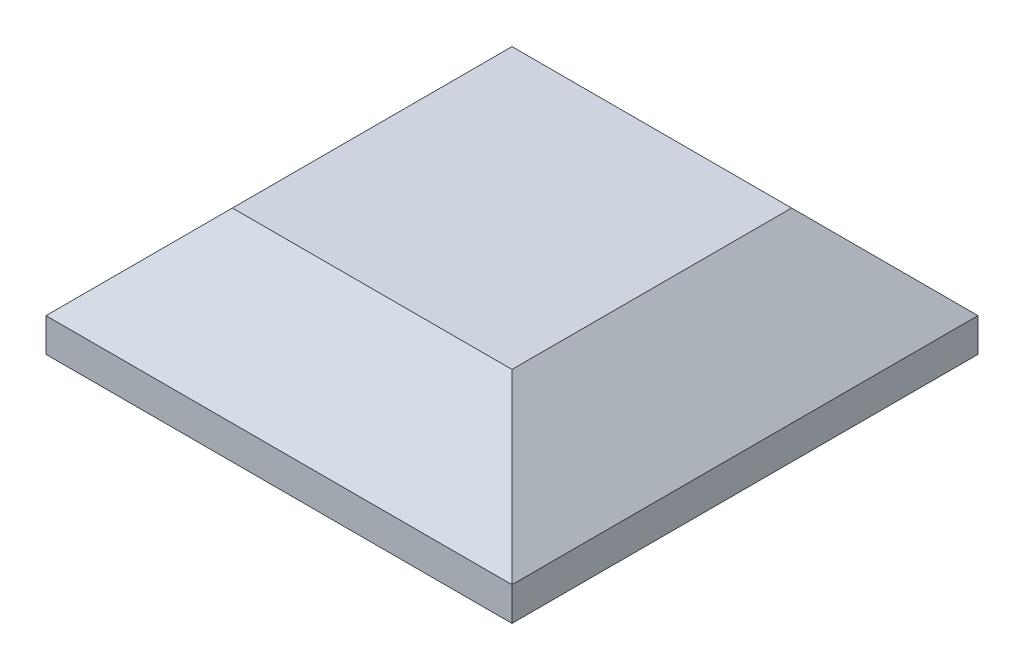
ISO-10303-21;
HEADER;
FILE_DESCRIPTION(('STEP AP214'),'2;1');
FILE_NAME('part.step','',(''),(''),'','','');
FILE_SCHEMA(('AUTOMOTIVE_DESIGN { 1 0 10303 214 1 1 1 1 }'));
ENDSEC;
DATA;
#1=APPLICATION_CONTEXT('core data for automotive mechanical design processes');
#2=APPLICATION_PROTOCOL_DEFINITION('international standard','automotive_design',2000,#1);
#3=PRODUCT_CONTEXT('',#1,'mechanical');
#4=PRODUCT('Part','Part','',(#3));
#5=PRODUCT_RELATED_PRODUCT_CATEGORY('part','',(#4));
#6=PRODUCT_DEFINITION_FORMATION('','',#4);
#7=PRODUCT_DEFINITION_CONTEXT('part definition',#1,'design');
#8=PRODUCT_DEFINITION('design','',#6,#7);
#9=PRODUCT_DEFINITION_SHAPE('','',#8);
#10=(LENGTH_UNIT() NAMED_UNIT(*) SI_UNIT(.MILLI.,.METRE.));
#11=(NAMED_UNIT(*) PLANE_ANGLE_UNIT() SI_UNIT($,.RADIAN.));
#12=(NAMED_UNIT(*) SI_UNIT($,.STERADIAN.) SOLID_ANGLE_UNIT());
#13=UNCERTAINTY_MEASURE_WITH_UNIT(LENGTH_MEASURE(1.E-05),#10,'distance_accuracy_value','');
#14=(GEOMETRIC_REPRESENTATION_CONTEXT(3) GLOBAL_UNCERTAINTY_ASSIGNED_CONTEXT((#13)) GLOBAL_UNIT_ASSIGNED_CONTEXT((#10,
#11,#12)) REPRESENTATION_CONTEXT('',''));
#15=CARTESIAN_POINT('',(0.,0.,0.));
#16=DIRECTION('',(0.,0.,1.));
#17=DIRECTION('',(1.,0.,0.));
#18=AXIS2_PLACEMENT_3D('',#15,#16,#17);
#19=CARTESIAN_POINT('',(0.715042372881359,3.4,5.03177966101695));
#20=DIRECTION('',(-1.,0.,0.));
#21=DIRECTION('',(0.,0.,1.));
#22=AXIS2_PLACEMENT_3D('',#19,#20,#21);
#23=PLANE('',#22);
#24=DIRECTION('',(0.,-1.,0.));
#25=VECTOR('',#24,1.);
#26=CARTESIAN_POINT('',(0.715042372881359,3.4,-7.46822033898305));
#27=LINE('',#26,#25);
#28=CARTESIAN_POINT('',(0.715042372881359,0.899999999999991,-7.46822033898305));
#29=VERTEX_POINT('',#28);
#30=CARTESIAN_POINT('',(0.715042372881359,0.,-7.46822033898305));
#31=VERTEX_POINT('',#30);
#32=EDGE_CURVE('E89',#29,#31,#27,.T.);
#33=ORIENTED_EDGE('',*,*,#32,.F.);
#34=DIRECTION('',(0.,0.,1.));
#35=VECTOR('',#34,1.);
#36=CARTESIAN_POINT('',(0.715042372881359,0.899999999999991,5.03177966101695));
#37=LINE('',#36,#35);
#38=CARTESIAN_POINT('',(0.715042372881359,0.899999999999991,5.03177966101695));
#39=VERTEX_POINT('',#38);
#40=EDGE_CURVE('E11',#29,#39,#37,.T.);
#41=ORIENTED_EDGE('',*,*,#40,.T.);
#42=DIRECTION('',(0.,-1.,0.));
#43=VECTOR('',#42,1.);
#44=CARTESIAN_POINT('',(0.715042372881359,3.4,5.03177966101695));
#45=LINE('',#44,#43);
#46=CARTESIAN_POINT('',(0.715042372881359,0.,5.03177966101695));
#47=VERTEX_POINT('',#46);
#48=EDGE_CURVE('E109',#39,#47,#45,.T.);
#49=ORIENTED_EDGE('',*,*,#48,.T.);
#50=DIRECTION('',(0.,0.,-1.));
#51=VECTOR('',#50,1.);
#52=CARTESIAN_POINT('',(0.715042372881359,0.,5.03177966101695));
#53=LINE('',#52,#51);
#54=EDGE_CURVE('E104',#47,#31,#53,.T.);
#55=ORIENTED_EDGE('',*,*,#54,.T.);
#56=EDGE_LOOP('',(#33,#41,#49,#55));
#57=FACE_BOUND('',#56,.T.);
#58=ADVANCED_FACE('F37',(#57),#23,.F.);
#59=CARTESIAN_POINT('',(0.715042372881359,3.4,-7.46822033898305));
#60=DIRECTION('',(0.,0.,1.));
#61=DIRECTION('',(1.,0.,0.));
#62=AXIS2_PLACEMENT_3D('',#59,#60,#61);
#63=PLANE('',#62);
#64=DIRECTION('',(0.,-1.,0.));
#65=VECTOR('',#64,1.);
#66=CARTESIAN_POINT('',(-11.7849576271186,3.4,-7.46822033898305));
#67=LINE('',#66,#65);
#68=CARTESIAN_POINT('',(-11.7849576271186,0.89999999999999,-7.46822033898305));
#69=VERTEX_POINT('',#68);
#70=CARTESIAN_POINT('',(-11.7849576271186,0.,-7.46822033898305));
#71=VERTEX_POINT('',#70);
#72=EDGE_CURVE('E98',#69,#71,#67,.T.);
#73=ORIENTED_EDGE('',*,*,#72,.F.);
#74=DIRECTION('',(1.,0.,0.));
#75=VECTOR('',#74,1.);
#76=CARTESIAN_POINT('',(0.715042372881359,0.89999999999999,-7.46822033898305));
#77=LINE('',#76,#75);
#78=EDGE_CURVE('E46',#69,#29,#77,.T.);
#79=ORIENTED_EDGE('',*,*,#78,.T.);
#80=ORIENTED_EDGE('',*,*,#32,.T.);
#81=DIRECTION('',(-1.,0.,0.));
#82=VECTOR('',#81,1.);
#83=CARTESIAN_POINT('',(0.715042372881359,0.,-7.46822033898305));
#84=LINE('',#83,#82);
#85=EDGE_CURVE('E92',#31,#71,#84,.T.);
#86=ORIENTED_EDGE('',*,*,#85,.T.);
#87=EDGE_LOOP('',(#73,#79,#80,#86));
#88=FACE_BOUND('',#87,.T.);
#89=ADVANCED_FACE('F91',(#88),#63,.F.);
#90=CARTESIAN_POINT('',(-11.7849576271186,3.4,5.03177966101695));
#91=DIRECTION('',(1.,0.,0.));
#92=DIRECTION('',(0.,0.,-1.));
#93=AXIS2_PLACEMENT_3D('',#90,#91,#92);
#94=PLANE('',#93);
#95=DIRECTION('',(0.,-1.,0.));
#96=VECTOR('',#95,1.);
#97=CARTESIAN_POINT('',(-11.7849576271186,3.4,5.03177966101695));
#98=LINE('',#97,#96);
#99=CARTESIAN_POINT('',(-11.7849576271186,0.899999999999991,5.03177966101695));
#100=VERTEX_POINT('',#99);
#101=CARTESIAN_POINT('',(-11.7849576271186,0.,5.03177966101695));
#102=VERTEX_POINT('',#101);
#103=EDGE_CURVE('E119',#100,#102,#98,.T.);
#104=ORIENTED_EDGE('',*,*,#103,.F.);
#105=DIRECTION('',(0.,0.,-1.));
#106=VECTOR('',#105,1.);
#107=CARTESIAN_POINT('',(-11.7849576271186,0.899999999999991,-7.46822033898305));
#108=LINE('',#107,#106);
#109=EDGE_CURVE('E61',#100,#69,#108,.T.);
#110=ORIENTED_EDGE('',*,*,#109,.T.);
#111=ORIENTED_EDGE('',*,*,#72,.T.);
#112=DIRECTION('',(0.,0.,1.));
#113=VECTOR('',#112,1.);
#114=CARTESIAN_POINT('',(-11.7849576271186,0.,5.03177966101695));
#115=LINE('',#114,#113);
#116=EDGE_CURVE('E106',#71,#102,#115,.T.);
#117=ORIENTED_EDGE('',*,*,#116,.T.);
#118=EDGE_LOOP('',(#104,#110,#111,#117));
#119=FACE_BOUND('',#118,.T.);
#120=ADVANCED_FACE('F157',(#119),#94,.F.);
#121=CARTESIAN_POINT('',(0.715042372881359,3.4,5.03177966101695));
#122=DIRECTION('',(0.,0.,-1.));
#123=DIRECTION('',(-1.,0.,0.));
#124=AXIS2_PLACEMENT_3D('',#121,#122,#123);
#125=PLANE('',#124);
#126=ORIENTED_EDGE('',*,*,#48,.F.);
#127=DIRECTION('',(-1.,0.,0.));
#128=VECTOR('',#127,1.);
#129=CARTESIAN_POINT('',(-11.7849576271186,0.89999999999999,5.03177966101695));
#130=LINE('',#129,#128);
#131=EDGE_CURVE('E130',#39,#100,#130,.T.);
#132=ORIENTED_EDGE('',*,*,#131,.T.);
#133=ORIENTED_EDGE('',*,*,#103,.T.);
#134=DIRECTION('',(1.,0.,0.));
#135=VECTOR('',#134,1.);
#136=CARTESIAN_POINT('',(0.715042372881359,0.,5.03177966101695));
#137=LINE('',#136,#135);
#138=EDGE_CURVE('E116',#102,#47,#137,.T.);
#139=ORIENTED_EDGE('',*,*,#138,.T.);
#140=EDGE_LOOP('',(#126,#132,#133,#139));
#141=FACE_BOUND('',#140,.T.);
#142=ADVANCED_FACE('F156',(#141),#125,.F.);
#143=CARTESIAN_POINT('',(0.,3.4,0.));
#144=DIRECTION('',(0.,1.,0.));
#145=DIRECTION('',(0.,0.,1.));
#146=AXIS2_PLACEMENT_3D('',#143,#144,#145);
#147=PLANE('',#146);
#148=DIRECTION('',(0.,0.,1.));
#149=VECTOR('',#148,1.);
#150=CARTESIAN_POINT('',(-9.28495762711864,3.4,5.03177966101695));
#151=LINE('',#150,#149);
#152=CARTESIAN_POINT('',(-9.28495762711864,3.4,-4.96822033898305));
#153=VERTEX_POINT('',#152);
#154=CARTESIAN_POINT('',(-9.28495762711864,3.4,2.53177966101695));
#155=VERTEX_POINT('',#154);
#156=EDGE_CURVE('E125',#153,#155,#151,.T.);
#157=ORIENTED_EDGE('',*,*,#156,.T.);
#158=DIRECTION('',(1.,0.,0.));
#159=VECTOR('',#158,1.);
#160=CARTESIAN_POINT('',(0.715042372881359,3.4,2.53177966101694));
#161=LINE('',#160,#159);
#162=CARTESIAN_POINT('',(-1.78495762711864,3.4,2.53177966101695));
#163=VERTEX_POINT('',#162);
#164=EDGE_CURVE('E127',#155,#163,#161,.T.);
#165=ORIENTED_EDGE('',*,*,#164,.T.);
#166=DIRECTION('',(0.,0.,-1.));
#167=VECTOR('',#166,1.);
#168=CARTESIAN_POINT('',(-1.78495762711864,3.4,-7.46822033898305));
#169=LINE('',#168,#167);
#170=CARTESIAN_POINT('',(-1.78495762711864,3.4,-4.96822033898305));
#171=VERTEX_POINT('',#170);
#172=EDGE_CURVE('E97',#163,#171,#169,.T.);
#173=ORIENTED_EDGE('',*,*,#172,.T.);
#174=DIRECTION('',(-1.,0.,0.));
#175=VECTOR('',#174,1.);
#176=CARTESIAN_POINT('',(-11.7849576271186,3.4,-4.96822033898305));
#177=LINE('',#176,#175);
#178=EDGE_CURVE('E123',#171,#153,#177,.T.);
#179=ORIENTED_EDGE('',*,*,#178,.T.);
#180=EDGE_LOOP('',(#157,#165,#173,#179));
#181=FACE_BOUND('',#180,.T.);
#182=ADVANCED_FACE('F149',(#181),#147,.T.);
#183=CARTESIAN_POINT('',(0.,0.,0.));
#184=DIRECTION('',(0.,1.,0.));
#185=DIRECTION('',(0.,0.,1.));
#186=AXIS2_PLACEMENT_3D('',#183,#184,#185);
#187=PLANE('',#186);
#188=ORIENTED_EDGE('',*,*,#54,.F.);
#189=ORIENTED_EDGE('',*,*,#138,.F.);
#190=ORIENTED_EDGE('',*,*,#116,.F.);
#191=ORIENTED_EDGE('',*,*,#85,.F.);
#192=EDGE_LOOP('',(#188,#189,#190,#191));
#193=FACE_BOUND('',#192,.T.);
#194=ADVANCED_FACE('F102',(#193),#187,.F.);
#195=CARTESIAN_POINT('',(0.,3.4,-4.96822033898305));
#196=DIRECTION('',(0.,0.707106781186547,-0.707106781186548));
#197=DIRECTION('',(1.,0.,0.));
#198=AXIS2_PLACEMENT_3D('',#195,#196,#197);
#199=PLANE('',#198);
#200=DIRECTION('',(-0.577350269189625,0.577350269189627,0.577350269189625));
#201=VECTOR('',#200,1.);
#202=CARTESIAN_POINT('',(-3.44103107344632,5.05607344632769,-3.31214689265537));
#203=LINE('',#202,#201);
#204=EDGE_CURVE('E113',#29,#171,#203,.T.);
#205=ORIENTED_EDGE('',*,*,#204,.F.);
#206=ORIENTED_EDGE('',*,*,#78,.F.);
#207=DIRECTION('',(0.577350269189625,0.577350269189627,0.577350269189625));
#208=VECTOR('',#207,1.);
#209=CARTESIAN_POINT('',(-6.18997175141243,6.49498587570621,-1.87323446327684));
#210=LINE('',#209,#208);
#211=EDGE_CURVE('E41',#153,#69,#210,.F.);
#212=ORIENTED_EDGE('',*,*,#211,.F.);
#213=ORIENTED_EDGE('',*,*,#178,.F.);
#214=EDGE_LOOP('',(#205,#206,#212,#213));
#215=FACE_BOUND('',#214,.T.);
#216=ADVANCED_FACE('F39',(#215),#199,.T.);
#217=CARTESIAN_POINT('',(-9.28495762711864,3.4,0.));
#218=DIRECTION('',(-0.707106781186549,0.707106781186547,0.));
#219=DIRECTION('',(0.,0.,-1.));
#220=AXIS2_PLACEMENT_3D('',#217,#218,#219);
#221=PLANE('',#220);
#222=ORIENTED_EDGE('',*,*,#211,.T.);
#223=ORIENTED_EDGE('',*,*,#109,.F.);
#224=DIRECTION('',(0.577350269189625,0.577350269189627,-0.577350269189625));
#225=VECTOR('',#224,1.);
#226=CARTESIAN_POINT('',(-8.44103107344632,4.24392655367232,1.68785310734463));
#227=LINE('',#226,#225);
#228=EDGE_CURVE('E137',#155,#100,#227,.F.);
#229=ORIENTED_EDGE('',*,*,#228,.F.);
#230=ORIENTED_EDGE('',*,*,#156,.F.);
#231=EDGE_LOOP('',(#222,#223,#229,#230));
#232=FACE_BOUND('',#231,.T.);
#233=ADVANCED_FACE('F174',(#232),#221,.T.);
#234=CARTESIAN_POINT('',(-1.78495762711864,3.4,0.));
#235=DIRECTION('',(0.707106781186549,0.707106781186547,0.));
#236=DIRECTION('',(0.,0.,1.));
#237=AXIS2_PLACEMENT_3D('',#234,#235,#236);
#238=PLANE('',#237);
#239=ORIENTED_EDGE('',*,*,#204,.T.);
#240=ORIENTED_EDGE('',*,*,#172,.F.);
#241=DIRECTION('',(0.577350269189625,-0.577350269189627,0.577350269189625));
#242=VECTOR('',#241,1.);
#243=CARTESIAN_POINT('',(-2.62888418079096,4.24392655367232,1.68785310734463));
#244=LINE('',#243,#242);
#245=EDGE_CURVE('E135',#39,#163,#244,.F.);
#246=ORIENTED_EDGE('',*,*,#245,.F.);
#247=ORIENTED_EDGE('',*,*,#40,.F.);
#248=EDGE_LOOP('',(#239,#240,#246,#247));
#249=FACE_BOUND('',#248,.T.);
#250=ADVANCED_FACE('F142',(#249),#238,.T.);
#251=CARTESIAN_POINT('',(0.,3.4,2.53177966101694));
#252=DIRECTION('',(0.,0.707106781186547,0.707106781186549));
#253=DIRECTION('',(-1.,0.,0.));
#254=AXIS2_PLACEMENT_3D('',#251,#252,#253);
#255=PLANE('',#254);
#256=ORIENTED_EDGE('',*,*,#228,.T.);
#257=ORIENTED_EDGE('',*,*,#131,.F.);
#258=ORIENTED_EDGE('',*,*,#245,.T.);
#259=ORIENTED_EDGE('',*,*,#164,.F.);
#260=EDGE_LOOP('',(#256,#257,#258,#259));
#261=FACE_BOUND('',#260,.T.);
#262=ADVANCED_FACE('F153',(#261),#255,.T.);
#263=CLOSED_SHELL('',(#58,#89,#120,#142,#182,#194,#216,#233,#250,#262));
#264=MANIFOLD_SOLID_BREP('B2',#263);
#265=ADVANCED_BREP_SHAPE_REPRESENTATION('',(#18,#264),#14);
#266=SHAPE_DEFINITION_REPRESENTATION(#9,#265);
ENDSEC;
END-ISO-10303-21;
